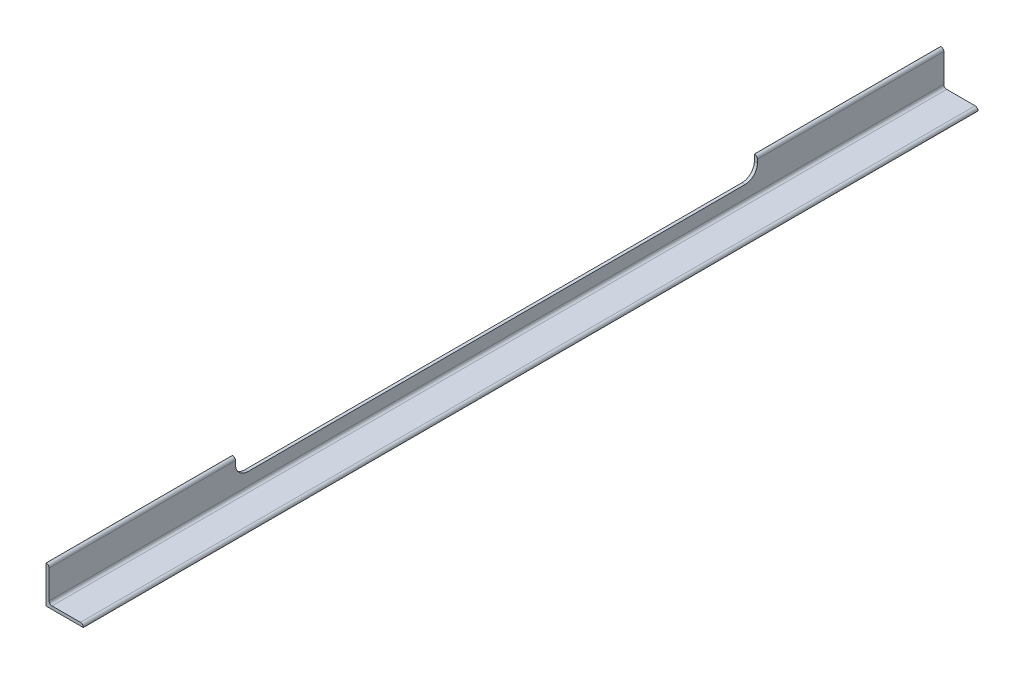
ISO-10303-21;
HEADER;
FILE_DESCRIPTION(('STEP AP214'),'2;1');
FILE_NAME('part.step','',(''),(''),'','','');
FILE_SCHEMA(('AUTOMOTIVE_DESIGN { 1 0 10303 214 1 1 1 1 }'));
ENDSEC;
DATA;
#1=APPLICATION_CONTEXT('core data for automotive mechanical design processes');
#2=APPLICATION_PROTOCOL_DEFINITION('international standard','automotive_design',2000,#1);
#3=PRODUCT_CONTEXT('',#1,'mechanical');
#4=PRODUCT('Part','Part','',(#3));
#5=PRODUCT_RELATED_PRODUCT_CATEGORY('part','',(#4));
#6=PRODUCT_DEFINITION_FORMATION('','',#4);
#7=PRODUCT_DEFINITION_CONTEXT('part definition',#1,'design');
#8=PRODUCT_DEFINITION('design','',#6,#7);
#9=PRODUCT_DEFINITION_SHAPE('','',#8);
#10=(LENGTH_UNIT() NAMED_UNIT(*) SI_UNIT(.MILLI.,.METRE.));
#11=(NAMED_UNIT(*) PLANE_ANGLE_UNIT() SI_UNIT($,.RADIAN.));
#12=(NAMED_UNIT(*) SI_UNIT($,.STERADIAN.) SOLID_ANGLE_UNIT());
#13=UNCERTAINTY_MEASURE_WITH_UNIT(LENGTH_MEASURE(1.E-05),#10,'distance_accuracy_value','');
#14=(GEOMETRIC_REPRESENTATION_CONTEXT(3) GLOBAL_UNCERTAINTY_ASSIGNED_CONTEXT((#13)) GLOBAL_UNIT_ASSIGNED_CONTEXT((#10,
#11,#12)) REPRESENTATION_CONTEXT('',''));
#15=CARTESIAN_POINT('',(0.,0.,0.));
#16=DIRECTION('',(0.,0.,1.));
#17=DIRECTION('',(1.,0.,0.));
#18=AXIS2_PLACEMENT_3D('',#15,#16,#17);
#19=CARTESIAN_POINT('',(-25.3455714285714,25.7225396825396,0.));
#20=DIRECTION('',(0.,0.,1.));
#21=DIRECTION('',(1.,0.,0.));
#22=AXIS2_PLACEMENT_3D('',#19,#20,#21);
#23=CYLINDRICAL_SURFACE('',#22,5.842);
#24=CARTESIAN_POINT('',(-25.3455714285714,25.7225396825396,381.));
#25=DIRECTION('',(0.,0.,1.));
#26=DIRECTION('',(1.,0.,0.));
#27=AXIS2_PLACEMENT_3D('',#24,#25,#26);
#28=CIRCLE('',#27,5.842);
#29=CARTESIAN_POINT('',(-25.3455714285714,31.5645396825396,381.));
#30=VERTEX_POINT('',#29);
#31=CARTESIAN_POINT('',(-19.5035714285714,25.7225396825396,381.));
#32=VERTEX_POINT('',#31);
#33=EDGE_CURVE('E148',#30,#32,#28,.F.);
#34=ORIENTED_EDGE('',*,*,#33,.T.);
#35=DIRECTION('',(0.,0.,-1.));
#36=VECTOR('',#35,1.);
#37=CARTESIAN_POINT('',(-19.5035714285714,25.7225396825396,0.));
#38=LINE('',#37,#36);
#39=CARTESIAN_POINT('',(-19.5035714285714,25.7225396825396,0.));
#40=VERTEX_POINT('',#39);
#41=EDGE_CURVE('E131',#40,#32,#38,.F.);
#42=ORIENTED_EDGE('',*,*,#41,.F.);
#43=CARTESIAN_POINT('',(-25.3455714285714,25.7225396825396,0.));
#44=DIRECTION('',(0.,0.,1.));
#45=DIRECTION('',(1.,0.,0.));
#46=AXIS2_PLACEMENT_3D('',#43,#44,#45);
#47=CIRCLE('',#46,5.842);
#48=CARTESIAN_POINT('',(-25.3455714285714,31.5645396825396,0.));
#49=VERTEX_POINT('',#48);
#50=EDGE_CURVE('E225',#40,#49,#47,.T.);
#51=ORIENTED_EDGE('',*,*,#50,.T.);
#52=DIRECTION('',(0.,0.,1.));
#53=VECTOR('',#52,1.);
#54=CARTESIAN_POINT('',(-25.3455714285714,31.5645396825396,0.));
#55=LINE('',#54,#53);
#56=EDGE_CURVE('E161',#30,#49,#55,.F.);
#57=ORIENTED_EDGE('',*,*,#56,.F.);
#58=EDGE_LOOP('',(#34,#42,#51,#57));
#59=FACE_BOUND('',#58,.T.);
#60=ADVANCED_FACE('F17',(#59),#23,.T.);
#61=CARTESIAN_POINT('',(-19.5035714285714,25.7225396825396,0.));
#62=DIRECTION('',(1.,0.,0.));
#63=DIRECTION('',(0.,0.,-1.));
#64=AXIS2_PLACEMENT_3D('',#61,#62,#63);
#65=PLANE('',#64);
#66=DIRECTION('',(0.,1.,0.));
#67=VECTOR('',#66,1.);
#68=CARTESIAN_POINT('',(-19.5035714285714,-22.7441398090485,1828.8));
#69=LINE('',#68,#67);
#70=CARTESIAN_POINT('',(-19.5035714285714,-32.4434603174604,1828.8));
#71=VERTEX_POINT('',#70);
#72=CARTESIAN_POINT('',(-19.5035714285714,25.7225396825396,1828.8));
#73=VERTEX_POINT('',#72);
#74=EDGE_CURVE('E175',#71,#73,#69,.T.);
#75=ORIENTED_EDGE('',*,*,#74,.F.);
#76=DIRECTION('',(0.,0.,1.));
#77=VECTOR('',#76,1.);
#78=CARTESIAN_POINT('',(-19.5035714285714,-32.4434603174604,0.));
#79=LINE('',#78,#77);
#80=CARTESIAN_POINT('',(-19.5035714285714,-32.4434603174604,0.));
#81=VERTEX_POINT('',#80);
#82=EDGE_CURVE('E167',#71,#81,#79,.F.);
#83=ORIENTED_EDGE('',*,*,#82,.T.);
#84=DIRECTION('',(0.,1.,0.));
#85=VECTOR('',#84,1.);
#86=CARTESIAN_POINT('',(-19.5035714285714,-22.7441398090485,0.));
#87=LINE('',#86,#85);
#88=EDGE_CURVE('E227',#81,#40,#87,.T.);
#89=ORIENTED_EDGE('',*,*,#88,.T.);
#90=ORIENTED_EDGE('',*,*,#41,.T.);
#91=DIRECTION('',(0.,1.,0.));
#92=VECTOR('',#91,1.);
#93=CARTESIAN_POINT('',(-19.5035714285714,31.5645396825396,381.));
#94=LINE('',#93,#92);
#95=CARTESIAN_POINT('',(-19.5035714285714,18.8645396825396,381.));
#96=VERTEX_POINT('',#95);
#97=EDGE_CURVE('E126',#32,#96,#94,.F.);
#98=ORIENTED_EDGE('',*,*,#97,.T.);
#99=CARTESIAN_POINT('',(-19.5035714285714,18.8645396825396,406.4));
#100=DIRECTION('',(1.,0.,0.));
#101=DIRECTION('',(0.,0.,-1.));
#102=AXIS2_PLACEMENT_3D('',#99,#100,#101);
#103=CIRCLE('',#102,25.3999999999998);
#104=CARTESIAN_POINT('',(-19.5035714285714,-6.5354603174603,406.4));
#105=VERTEX_POINT('',#104);
#106=EDGE_CURVE('E20',#96,#105,#103,.F.);
#107=ORIENTED_EDGE('',*,*,#106,.T.);
#108=DIRECTION('',(0.,0.,-1.));
#109=VECTOR('',#108,1.);
#110=CARTESIAN_POINT('',(-19.5035714285714,-6.53546031746041,406.4));
#111=LINE('',#110,#109);
#112=CARTESIAN_POINT('',(-19.5035714285714,-6.53546031746046,1422.4));
#113=VERTEX_POINT('',#112);
#114=EDGE_CURVE('E143',#105,#113,#111,.F.);
#115=ORIENTED_EDGE('',*,*,#114,.T.);
#116=CARTESIAN_POINT('',(-19.5035714285714,18.8645396825398,1422.4));
#117=DIRECTION('',(1.,0.,0.));
#118=DIRECTION('',(0.,0.,-1.));
#119=AXIS2_PLACEMENT_3D('',#116,#117,#118);
#120=CIRCLE('',#119,25.4000000000003);
#121=CARTESIAN_POINT('',(-19.5035714285714,18.8645396825397,1447.8));
#122=VERTEX_POINT('',#121);
#123=EDGE_CURVE('E235',#113,#122,#120,.F.);
#124=ORIENTED_EDGE('',*,*,#123,.T.);
#125=DIRECTION('',(0.,1.,0.));
#126=VECTOR('',#125,1.);
#127=CARTESIAN_POINT('',(-19.5035714285714,18.8645396825398,1447.8));
#128=LINE('',#127,#126);
#129=CARTESIAN_POINT('',(-19.5035714285714,25.7225396825396,1447.8));
#130=VERTEX_POINT('',#129);
#131=EDGE_CURVE('E186',#122,#130,#128,.T.);
#132=ORIENTED_EDGE('',*,*,#131,.T.);
#133=DIRECTION('',(0.,0.,1.));
#134=VECTOR('',#133,1.);
#135=CARTESIAN_POINT('',(-19.5035714285714,25.7225396825396,0.));
#136=LINE('',#135,#134);
#137=EDGE_CURVE('E172',#73,#130,#136,.F.);
#138=ORIENTED_EDGE('',*,*,#137,.F.);
#139=EDGE_LOOP('',(#75,#83,#89,#90,#98,#107,#115,#124,#132,#138));
#140=FACE_BOUND('',#139,.T.);
#141=ADVANCED_FACE('F128',(#140),#65,.T.);
#142=CARTESIAN_POINT('',(-25.3455714285714,25.7225396825396,0.));
#143=DIRECTION('',(0.,0.,1.));
#144=DIRECTION('',(1.,0.,0.));
#145=AXIS2_PLACEMENT_3D('',#142,#143,#144);
#146=CYLINDRICAL_SURFACE('',#145,5.842);
#147=CARTESIAN_POINT('',(-25.3455714285714,25.7225396825396,1447.8));
#148=DIRECTION('',(0.,0.,1.));
#149=DIRECTION('',(1.,0.,0.));
#150=AXIS2_PLACEMENT_3D('',#147,#148,#149);
#151=CIRCLE('',#150,5.842);
#152=CARTESIAN_POINT('',(-25.3455714285714,31.5645396825396,1447.8));
#153=VERTEX_POINT('',#152);
#154=EDGE_CURVE('E239',#130,#153,#151,.T.);
#155=ORIENTED_EDGE('',*,*,#154,.T.);
#156=DIRECTION('',(0.,0.,1.));
#157=VECTOR('',#156,1.);
#158=CARTESIAN_POINT('',(-25.3455714285714,31.5645396825396,0.));
#159=LINE('',#158,#157);
#160=CARTESIAN_POINT('',(-25.3455714285714,31.5645396825396,1828.8));
#161=VERTEX_POINT('',#160);
#162=EDGE_CURVE('E183',#161,#153,#159,.F.);
#163=ORIENTED_EDGE('',*,*,#162,.F.);
#164=CARTESIAN_POINT('',(-25.3455714285714,25.7225396825396,1828.8));
#165=DIRECTION('',(0.,0.,1.));
#166=DIRECTION('',(1.,0.,0.));
#167=AXIS2_PLACEMENT_3D('',#164,#165,#166);
#168=CIRCLE('',#167,5.842);
#169=EDGE_CURVE('E221',#73,#161,#168,.T.);
#170=ORIENTED_EDGE('',*,*,#169,.F.);
#171=ORIENTED_EDGE('',*,*,#137,.T.);
#172=EDGE_LOOP('',(#155,#163,#170,#171));
#173=FACE_BOUND('',#172,.T.);
#174=ADVANCED_FACE('F305',(#173),#146,.T.);
#175=CARTESIAN_POINT('',(44.5044285714286,-44.1274603174604,0.));
#176=DIRECTION('',(0.,0.,1.));
#177=DIRECTION('',(1.,0.,0.));
#178=AXIS2_PLACEMENT_3D('',#175,#176,#177);
#179=CYLINDRICAL_SURFACE('',#178,5.842);
#180=CARTESIAN_POINT('',(44.5044285714286,-44.1274603174604,1828.8));
#181=DIRECTION('',(0.,0.,1.));
#182=DIRECTION('',(1.,0.,0.));
#183=AXIS2_PLACEMENT_3D('',#180,#181,#182);
#184=CIRCLE('',#183,5.842);
#185=CARTESIAN_POINT('',(50.3464285714286,-44.1274603174604,1828.8));
#186=VERTEX_POINT('',#185);
#187=CARTESIAN_POINT('',(44.5044285714286,-38.2854603174604,1828.8));
#188=VERTEX_POINT('',#187);
#189=EDGE_CURVE('E217',#186,#188,#184,.T.);
#190=ORIENTED_EDGE('',*,*,#189,.F.);
#191=DIRECTION('',(0.,0.,-1.));
#192=VECTOR('',#191,1.);
#193=CARTESIAN_POINT('',(50.3464285714286,-44.1274603174604,0.));
#194=LINE('',#193,#192);
#195=CARTESIAN_POINT('',(50.3464285714286,-44.1274603174604,0.));
#196=VERTEX_POINT('',#195);
#197=EDGE_CURVE('E173',#196,#186,#194,.F.);
#198=ORIENTED_EDGE('',*,*,#197,.F.);
#199=CARTESIAN_POINT('',(44.5044285714286,-44.1274603174604,0.));
#200=DIRECTION('',(0.,0.,1.));
#201=DIRECTION('',(1.,0.,0.));
#202=AXIS2_PLACEMENT_3D('',#199,#200,#201);
#203=CIRCLE('',#202,5.842);
#204=CARTESIAN_POINT('',(44.5044285714286,-38.2854603174604,0.));
#205=VERTEX_POINT('',#204);
#206=EDGE_CURVE('E232',#196,#205,#203,.T.);
#207=ORIENTED_EDGE('',*,*,#206,.T.);
#208=DIRECTION('',(0.,0.,1.));
#209=VECTOR('',#208,1.);
#210=CARTESIAN_POINT('',(44.5044285714286,-38.2854603174604,0.));
#211=LINE('',#210,#209);
#212=EDGE_CURVE('E169',#188,#205,#211,.F.);
#213=ORIENTED_EDGE('',*,*,#212,.F.);
#214=EDGE_LOOP('',(#190,#198,#207,#213));
#215=FACE_BOUND('',#214,.T.);
#216=ADVANCED_FACE('F445',(#215),#179,.T.);
#217=CARTESIAN_POINT('',(-13.6615714285714,-38.2854603174604,0.));
#218=DIRECTION('',(0.,1.,0.));
#219=DIRECTION('',(0.,0.,1.));
#220=AXIS2_PLACEMENT_3D('',#217,#218,#219);
#221=PLANE('',#220);
#222=DIRECTION('',(1.,0.,0.));
#223=VECTOR('',#222,1.);
#224=CARTESIAN_POINT('',(-3.96225092015965,-38.2854603174604,1828.8));
#225=LINE('',#224,#223);
#226=CARTESIAN_POINT('',(-13.6615714285714,-38.2854603174604,1828.8));
#227=VERTEX_POINT('',#226);
#228=EDGE_CURVE('E216',#188,#227,#225,.F.);
#229=ORIENTED_EDGE('',*,*,#228,.F.);
#230=ORIENTED_EDGE('',*,*,#212,.T.);
#231=DIRECTION('',(1.,0.,0.));
#232=VECTOR('',#231,1.);
#233=CARTESIAN_POINT('',(-3.96225092015965,-38.2854603174604,0.));
#234=LINE('',#233,#232);
#235=CARTESIAN_POINT('',(-13.6615714285714,-38.2854603174604,0.));
#236=VERTEX_POINT('',#235);
#237=EDGE_CURVE('E231',#205,#236,#234,.F.);
#238=ORIENTED_EDGE('',*,*,#237,.T.);
#239=DIRECTION('',(0.,0.,1.));
#240=VECTOR('',#239,1.);
#241=CARTESIAN_POINT('',(-13.6615714285714,-38.2854603174604,0.));
#242=LINE('',#241,#240);
#243=EDGE_CURVE('E165',#236,#227,#242,.T.);
#244=ORIENTED_EDGE('',*,*,#243,.T.);
#245=EDGE_LOOP('',(#229,#230,#238,#244));
#246=FACE_BOUND('',#245,.T.);
#247=ADVANCED_FACE('F436',(#246),#221,.T.);
#248=CARTESIAN_POINT('',(-13.6615714285714,-32.4434603174604,0.));
#249=DIRECTION('',(0.,0.,1.));
#250=DIRECTION('',(1.,0.,0.));
#251=AXIS2_PLACEMENT_3D('',#248,#249,#250);
#252=CYLINDRICAL_SURFACE('',#251,5.842);
#253=CARTESIAN_POINT('',(-13.6615714285714,-32.4434603174604,0.));
#254=DIRECTION('',(0.,0.,1.));
#255=DIRECTION('',(1.,0.,0.));
#256=AXIS2_PLACEMENT_3D('',#253,#254,#255);
#257=CIRCLE('',#256,5.842);
#258=EDGE_CURVE('E228',#236,#81,#257,.F.);
#259=ORIENTED_EDGE('',*,*,#258,.T.);
#260=ORIENTED_EDGE('',*,*,#82,.F.);
#261=CARTESIAN_POINT('',(-13.6615714285714,-32.4434603174604,1828.8));
#262=DIRECTION('',(0.,0.,1.));
#263=DIRECTION('',(1.,0.,0.));
#264=AXIS2_PLACEMENT_3D('',#261,#262,#263);
#265=CIRCLE('',#264,5.842);
#266=EDGE_CURVE('E213',#227,#71,#265,.F.);
#267=ORIENTED_EDGE('',*,*,#266,.F.);
#268=ORIENTED_EDGE('',*,*,#243,.F.);
#269=EDGE_LOOP('',(#259,#260,#267,#268));
#270=FACE_BOUND('',#269,.T.);
#271=ADVANCED_FACE('F309',(#270),#252,.F.);
#272=CARTESIAN_POINT('',(-25.8535714285714,-6.53546031746041,406.4));
#273=DIRECTION('',(0.,-1.,0.));
#274=DIRECTION('',(0.,0.,-1.));
#275=AXIS2_PLACEMENT_3D('',#272,#273,#274);
#276=PLANE('',#275);
#277=DIRECTION('',(0.,0.,1.));
#278=VECTOR('',#277,1.);
#279=CARTESIAN_POINT('',(-25.8535714285714,-6.5354603174604,0.));
#280=LINE('',#279,#278);
#281=CARTESIAN_POINT('',(-25.8535714285714,-6.53546031746045,1422.4));
#282=VERTEX_POINT('',#281);
#283=CARTESIAN_POINT('',(-25.8535714285714,-6.5354603174603,406.4));
#284=VERTEX_POINT('',#283);
#285=EDGE_CURVE('E212',#282,#284,#280,.F.);
#286=ORIENTED_EDGE('',*,*,#285,.F.);
#287=DIRECTION('',(1.,0.,0.));
#288=VECTOR('',#287,1.);
#289=CARTESIAN_POINT('',(-25.8535714285714,-6.5354603174605,1422.4));
#290=LINE('',#289,#288);
#291=EDGE_CURVE('E234',#282,#113,#290,.T.);
#292=ORIENTED_EDGE('',*,*,#291,.T.);
#293=ORIENTED_EDGE('',*,*,#114,.F.);
#294=DIRECTION('',(1.,0.,0.));
#295=VECTOR('',#294,1.);
#296=CARTESIAN_POINT('',(-25.8535714285714,-6.5354603174602,406.4));
#297=LINE('',#296,#295);
#298=EDGE_CURVE('E136',#105,#284,#297,.F.);
#299=ORIENTED_EDGE('',*,*,#298,.T.);
#300=EDGE_LOOP('',(#286,#292,#293,#299));
#301=FACE_BOUND('',#300,.T.);
#302=ADVANCED_FACE('F289',(#301),#276,.F.);
#303=CARTESIAN_POINT('',(-25.8535714285714,18.8645396825396,406.4));
#304=DIRECTION('',(1.,0.,0.));
#305=DIRECTION('',(0.,0.,-1.));
#306=AXIS2_PLACEMENT_3D('',#303,#304,#305);
#307=CYLINDRICAL_SURFACE('',#306,25.3999999999998);
#308=CARTESIAN_POINT('',(-25.8535714285714,18.8645396825396,406.4));
#309=DIRECTION('',(1.,0.,0.));
#310=DIRECTION('',(0.,0.,-1.));
#311=AXIS2_PLACEMENT_3D('',#308,#309,#310);
#312=CIRCLE('',#311,25.3999999999998);
#313=CARTESIAN_POINT('',(-25.8535714285714,18.8645396825396,381.));
#314=VERTEX_POINT('',#313);
#315=EDGE_CURVE('E210',#284,#314,#312,.T.);
#316=ORIENTED_EDGE('',*,*,#315,.F.);
#317=ORIENTED_EDGE('',*,*,#298,.F.);
#318=ORIENTED_EDGE('',*,*,#106,.F.);
#319=DIRECTION('',(-1.,0.,0.));
#320=VECTOR('',#319,1.);
#321=CARTESIAN_POINT('',(-25.8535714285714,18.8645396825396,381.));
#322=LINE('',#321,#320);
#323=EDGE_CURVE('E135',#96,#314,#322,.T.);
#324=ORIENTED_EDGE('',*,*,#323,.T.);
#325=EDGE_LOOP('',(#316,#317,#318,#324));
#326=FACE_BOUND('',#325,.T.);
#327=ADVANCED_FACE('F141',(#326),#307,.F.);
#328=CARTESIAN_POINT('',(-25.8535714285714,31.5645396825396,381.));
#329=DIRECTION('',(0.,0.,-1.));
#330=DIRECTION('',(-1.,0.,0.));
#331=AXIS2_PLACEMENT_3D('',#328,#329,#330);
#332=PLANE('',#331);
#333=DIRECTION('',(1.,0.,0.));
#334=VECTOR('',#333,1.);
#335=CARTESIAN_POINT('',(-25.8535714285714,31.5645396825396,381.));
#336=LINE('',#335,#334);
#337=CARTESIAN_POINT('',(-25.8535714285714,31.5645396825396,381.));
#338=VERTEX_POINT('',#337);
#339=EDGE_CURVE('E150',#338,#30,#336,.T.);
#340=ORIENTED_EDGE('',*,*,#339,.F.);
#341=DIRECTION('',(0.,1.,0.));
#342=VECTOR('',#341,1.);
#343=CARTESIAN_POINT('',(-25.8535714285714,-44.6354603174604,381.));
#344=LINE('',#343,#342);
#345=EDGE_CURVE('E146',#314,#338,#344,.T.);
#346=ORIENTED_EDGE('',*,*,#345,.F.);
#347=ORIENTED_EDGE('',*,*,#323,.F.);
#348=ORIENTED_EDGE('',*,*,#97,.F.);
#349=ORIENTED_EDGE('',*,*,#33,.F.);
#350=EDGE_LOOP('',(#340,#346,#347,#348,#349));
#351=FACE_BOUND('',#350,.T.);
#352=ADVANCED_FACE('F144',(#351),#332,.F.);
#353=CARTESIAN_POINT('',(-25.8535714285714,31.5645396825396,0.));
#354=DIRECTION('',(0.,1.,0.));
#355=DIRECTION('',(0.,0.,1.));
#356=AXIS2_PLACEMENT_3D('',#353,#354,#355);
#357=PLANE('',#356);
#358=ORIENTED_EDGE('',*,*,#339,.T.);
#359=ORIENTED_EDGE('',*,*,#56,.T.);
#360=DIRECTION('',(1.,0.,0.));
#361=VECTOR('',#360,1.);
#362=CARTESIAN_POINT('',(-3.96225092015965,31.5645396825396,0.));
#363=LINE('',#362,#361);
#364=CARTESIAN_POINT('',(-25.8535714285714,31.5645396825396,0.));
#365=VERTEX_POINT('',#364);
#366=EDGE_CURVE('E191',#49,#365,#363,.F.);
#367=ORIENTED_EDGE('',*,*,#366,.T.);
#368=DIRECTION('',(0.,0.,1.));
#369=VECTOR('',#368,1.);
#370=CARTESIAN_POINT('',(-25.8535714285714,31.5645396825396,0.));
#371=LINE('',#370,#369);
#372=EDGE_CURVE('E153',#338,#365,#371,.F.);
#373=ORIENTED_EDGE('',*,*,#372,.F.);
#374=EDGE_LOOP('',(#358,#359,#367,#373));
#375=FACE_BOUND('',#374,.T.);
#376=ADVANCED_FACE('F322',(#375),#357,.T.);
#377=CARTESIAN_POINT('',(-25.8535714285714,31.5645396825396,0.));
#378=DIRECTION('',(0.,1.,0.));
#379=DIRECTION('',(0.,0.,1.));
#380=AXIS2_PLACEMENT_3D('',#377,#378,#379);
#381=PLANE('',#380);
#382=DIRECTION('',(1.,0.,0.));
#383=VECTOR('',#382,1.);
#384=CARTESIAN_POINT('',(-25.8535714285714,31.5645396825396,1447.8));
#385=LINE('',#384,#383);
#386=CARTESIAN_POINT('',(-25.8535714285714,31.5645396825396,1447.8));
#387=VERTEX_POINT('',#386);
#388=EDGE_CURVE('E238',#153,#387,#385,.F.);
#389=ORIENTED_EDGE('',*,*,#388,.T.);
#390=DIRECTION('',(0.,0.,1.));
#391=VECTOR('',#390,1.);
#392=CARTESIAN_POINT('',(-25.8535714285714,31.5645396825396,0.));
#393=LINE('',#392,#391);
#394=CARTESIAN_POINT('',(-25.8535714285714,31.5645396825396,1828.8));
#395=VERTEX_POINT('',#394);
#396=EDGE_CURVE('E248',#395,#387,#393,.F.);
#397=ORIENTED_EDGE('',*,*,#396,.F.);
#398=DIRECTION('',(1.,0.,0.));
#399=VECTOR('',#398,1.);
#400=CARTESIAN_POINT('',(-3.96225092015965,31.5645396825396,1828.8));
#401=LINE('',#400,#399);
#402=EDGE_CURVE('E224',#161,#395,#401,.F.);
#403=ORIENTED_EDGE('',*,*,#402,.F.);
#404=ORIENTED_EDGE('',*,*,#162,.T.);
#405=EDGE_LOOP('',(#389,#397,#403,#404));
#406=FACE_BOUND('',#405,.T.);
#407=ADVANCED_FACE('F302',(#406),#381,.T.);
#408=CARTESIAN_POINT('',(-25.8535714285714,18.8645396825398,1447.8));
#409=DIRECTION('',(0.,0.,1.));
#410=DIRECTION('',(1.,0.,0.));
#411=AXIS2_PLACEMENT_3D('',#408,#409,#410);
#412=PLANE('',#411);
#413=DIRECTION('',(0.,1.,0.));
#414=VECTOR('',#413,1.);
#415=CARTESIAN_POINT('',(-25.8535714285714,-44.6354603174604,1447.8));
#416=LINE('',#415,#414);
#417=CARTESIAN_POINT('',(-25.8535714285714,18.8645396825397,1447.8));
#418=VERTEX_POINT('',#417);
#419=EDGE_CURVE('E209',#387,#418,#416,.F.);
#420=ORIENTED_EDGE('',*,*,#419,.F.);
#421=ORIENTED_EDGE('',*,*,#388,.F.);
#422=ORIENTED_EDGE('',*,*,#154,.F.);
#423=ORIENTED_EDGE('',*,*,#131,.F.);
#424=DIRECTION('',(1.,0.,0.));
#425=VECTOR('',#424,1.);
#426=CARTESIAN_POINT('',(-25.8535714285714,18.8645396825395,1447.8));
#427=LINE('',#426,#425);
#428=EDGE_CURVE('E237',#122,#418,#427,.F.);
#429=ORIENTED_EDGE('',*,*,#428,.T.);
#430=EDGE_LOOP('',(#420,#421,#422,#423,#429));
#431=FACE_BOUND('',#430,.T.);
#432=ADVANCED_FACE('F297',(#431),#412,.F.);
#433=CARTESIAN_POINT('',(-25.8535714285714,18.8645396825398,1422.4));
#434=DIRECTION('',(1.,0.,0.));
#435=DIRECTION('',(0.,0.,-1.));
#436=AXIS2_PLACEMENT_3D('',#433,#434,#435);
#437=CYLINDRICAL_SURFACE('',#436,25.4000000000003);
#438=CARTESIAN_POINT('',(-25.8535714285714,18.8645396825398,1422.4));
#439=DIRECTION('',(1.,0.,0.));
#440=DIRECTION('',(0.,0.,-1.));
#441=AXIS2_PLACEMENT_3D('',#438,#439,#440);
#442=CIRCLE('',#441,25.4000000000003);
#443=EDGE_CURVE('E196',#418,#282,#442,.T.);
#444=ORIENTED_EDGE('',*,*,#443,.F.);
#445=ORIENTED_EDGE('',*,*,#428,.F.);
#446=ORIENTED_EDGE('',*,*,#123,.F.);
#447=ORIENTED_EDGE('',*,*,#291,.F.);
#448=EDGE_LOOP('',(#444,#445,#446,#447));
#449=FACE_BOUND('',#448,.T.);
#450=ADVANCED_FACE('F294',(#449),#437,.F.);
#451=CARTESIAN_POINT('',(-3.96225092015965,-22.7441398090485,0.));
#452=DIRECTION('',(0.,0.,1.));
#453=DIRECTION('',(1.,0.,0.));
#454=AXIS2_PLACEMENT_3D('',#451,#452,#453);
#455=PLANE('',#454);
#456=ORIENTED_EDGE('',*,*,#50,.F.);
#457=ORIENTED_EDGE('',*,*,#88,.F.);
#458=ORIENTED_EDGE('',*,*,#258,.F.);
#459=ORIENTED_EDGE('',*,*,#237,.F.);
#460=ORIENTED_EDGE('',*,*,#206,.F.);
#461=DIRECTION('',(0.,1.,0.));
#462=VECTOR('',#461,1.);
#463=CARTESIAN_POINT('',(50.3464285714286,-44.1274603174604,0.));
#464=LINE('',#463,#462);
#465=CARTESIAN_POINT('',(50.3464285714286,-44.6354603174604,0.));
#466=VERTEX_POINT('',#465);
#467=EDGE_CURVE('E176',#466,#196,#464,.T.);
#468=ORIENTED_EDGE('',*,*,#467,.F.);
#469=DIRECTION('',(1.,0.,0.));
#470=VECTOR('',#469,1.);
#471=CARTESIAN_POINT('',(50.3464285714286,-44.6354603174604,0.));
#472=LINE('',#471,#470);
#473=CARTESIAN_POINT('',(-25.8535714285714,-44.6354603174604,0.));
#474=VERTEX_POINT('',#473);
#475=EDGE_CURVE('E180',#474,#466,#472,.T.);
#476=ORIENTED_EDGE('',*,*,#475,.F.);
#477=DIRECTION('',(0.,1.,0.));
#478=VECTOR('',#477,1.);
#479=CARTESIAN_POINT('',(-25.8535714285714,-44.6354603174604,0.));
#480=LINE('',#479,#478);
#481=EDGE_CURVE('E156',#365,#474,#480,.F.);
#482=ORIENTED_EDGE('',*,*,#481,.F.);
#483=ORIENTED_EDGE('',*,*,#366,.F.);
#484=EDGE_LOOP('',(#456,#457,#458,#459,#460,#468,#476,#482,#483));
#485=FACE_BOUND('',#484,.T.);
#486=ADVANCED_FACE('F316',(#485),#455,.F.);
#487=CARTESIAN_POINT('',(50.3464285714286,-44.1274603174604,0.));
#488=DIRECTION('',(1.,0.,0.));
#489=DIRECTION('',(0.,0.,-1.));
#490=AXIS2_PLACEMENT_3D('',#487,#488,#489);
#491=PLANE('',#490);
#492=DIRECTION('',(0.,1.,0.));
#493=VECTOR('',#492,1.);
#494=CARTESIAN_POINT('',(50.3464285714286,-22.7441398090485,1828.8));
#495=LINE('',#494,#493);
#496=CARTESIAN_POINT('',(50.3464285714286,-44.6354603174604,1828.8));
#497=VERTEX_POINT('',#496);
#498=EDGE_CURVE('E220',#497,#186,#495,.T.);
#499=ORIENTED_EDGE('',*,*,#498,.F.);
#500=DIRECTION('',(0.,0.,-1.));
#501=VECTOR('',#500,1.);
#502=CARTESIAN_POINT('',(50.3464285714286,-44.6354603174604,0.));
#503=LINE('',#502,#501);
#504=EDGE_CURVE('E177',#466,#497,#503,.F.);
#505=ORIENTED_EDGE('',*,*,#504,.F.);
#506=ORIENTED_EDGE('',*,*,#467,.T.);
#507=ORIENTED_EDGE('',*,*,#197,.T.);
#508=EDGE_LOOP('',(#499,#505,#506,#507));
#509=FACE_BOUND('',#508,.T.);
#510=ADVANCED_FACE('F334',(#509),#491,.T.);
#511=CARTESIAN_POINT('',(-3.96225092015965,-22.7441398090485,1828.8));
#512=DIRECTION('',(0.,0.,1.));
#513=DIRECTION('',(1.,0.,0.));
#514=AXIS2_PLACEMENT_3D('',#511,#512,#513);
#515=PLANE('',#514);
#516=ORIENTED_EDGE('',*,*,#228,.T.);
#517=ORIENTED_EDGE('',*,*,#266,.T.);
#518=ORIENTED_EDGE('',*,*,#74,.T.);
#519=ORIENTED_EDGE('',*,*,#169,.T.);
#520=ORIENTED_EDGE('',*,*,#402,.T.);
#521=DIRECTION('',(0.,1.,0.));
#522=VECTOR('',#521,1.);
#523=CARTESIAN_POINT('',(-25.8535714285714,-44.6354603174604,1828.8));
#524=LINE('',#523,#522);
#525=CARTESIAN_POINT('',(-25.8535714285714,-44.6354603174604,1828.8));
#526=VERTEX_POINT('',#525);
#527=EDGE_CURVE('E35',#526,#395,#524,.T.);
#528=ORIENTED_EDGE('',*,*,#527,.F.);
#529=DIRECTION('',(1.,0.,0.));
#530=VECTOR('',#529,1.);
#531=CARTESIAN_POINT('',(50.3464285714286,-44.6354603174604,1828.8));
#532=LINE('',#531,#530);
#533=EDGE_CURVE('E26',#497,#526,#532,.F.);
#534=ORIENTED_EDGE('',*,*,#533,.F.);
#535=ORIENTED_EDGE('',*,*,#498,.T.);
#536=ORIENTED_EDGE('',*,*,#189,.T.);
#537=EDGE_LOOP('',(#516,#517,#518,#519,#520,#528,#534,#535,#536));
#538=FACE_BOUND('',#537,.T.);
#539=ADVANCED_FACE('F265',(#538),#515,.T.);
#540=CARTESIAN_POINT('',(-25.8535714285714,-44.6354603174604,0.));
#541=DIRECTION('',(-1.,0.,0.));
#542=DIRECTION('',(0.,0.,1.));
#543=AXIS2_PLACEMENT_3D('',#540,#541,#542);
#544=PLANE('',#543);
#545=ORIENTED_EDGE('',*,*,#419,.T.);
#546=ORIENTED_EDGE('',*,*,#443,.T.);
#547=ORIENTED_EDGE('',*,*,#285,.T.);
#548=ORIENTED_EDGE('',*,*,#315,.T.);
#549=ORIENTED_EDGE('',*,*,#345,.T.);
#550=ORIENTED_EDGE('',*,*,#372,.T.);
#551=ORIENTED_EDGE('',*,*,#481,.T.);
#552=DIRECTION('',(0.,0.,-1.));
#553=VECTOR('',#552,1.);
#554=CARTESIAN_POINT('',(-25.8535714285714,-44.6354603174604,0.));
#555=LINE('',#554,#553);
#556=EDGE_CURVE('E11',#526,#474,#555,.T.);
#557=ORIENTED_EDGE('',*,*,#556,.F.);
#558=ORIENTED_EDGE('',*,*,#527,.T.);
#559=ORIENTED_EDGE('',*,*,#396,.T.);
#560=EDGE_LOOP('',(#545,#546,#547,#548,#549,#550,#551,#557,#558,#559));
#561=FACE_BOUND('',#560,.T.);
#562=ADVANCED_FACE('F325',(#561),#544,.T.);
#563=CARTESIAN_POINT('',(50.3464285714286,-44.6354603174604,0.));
#564=DIRECTION('',(0.,-1.,0.));
#565=DIRECTION('',(0.,0.,-1.));
#566=AXIS2_PLACEMENT_3D('',#563,#564,#565);
#567=PLANE('',#566);
#568=ORIENTED_EDGE('',*,*,#533,.T.);
#569=ORIENTED_EDGE('',*,*,#556,.T.);
#570=ORIENTED_EDGE('',*,*,#475,.T.);
#571=ORIENTED_EDGE('',*,*,#504,.T.);
#572=EDGE_LOOP('',(#568,#569,#570,#571));
#573=FACE_BOUND('',#572,.T.);
#574=ADVANCED_FACE('F261',(#573),#567,.T.);
#575=CLOSED_SHELL('',(#60,#141,#174,#216,#247,#271,#302,#327,#352,#376,#407,#432,#450,#486,#510,
#539,#562,#574));
#576=MANIFOLD_SOLID_BREP('B1',#575);
#577=ADVANCED_BREP_SHAPE_REPRESENTATION('',(#18,#576),#14);
#578=SHAPE_DEFINITION_REPRESENTATION(#9,#577);
ENDSEC;
END-ISO-10303-21;
